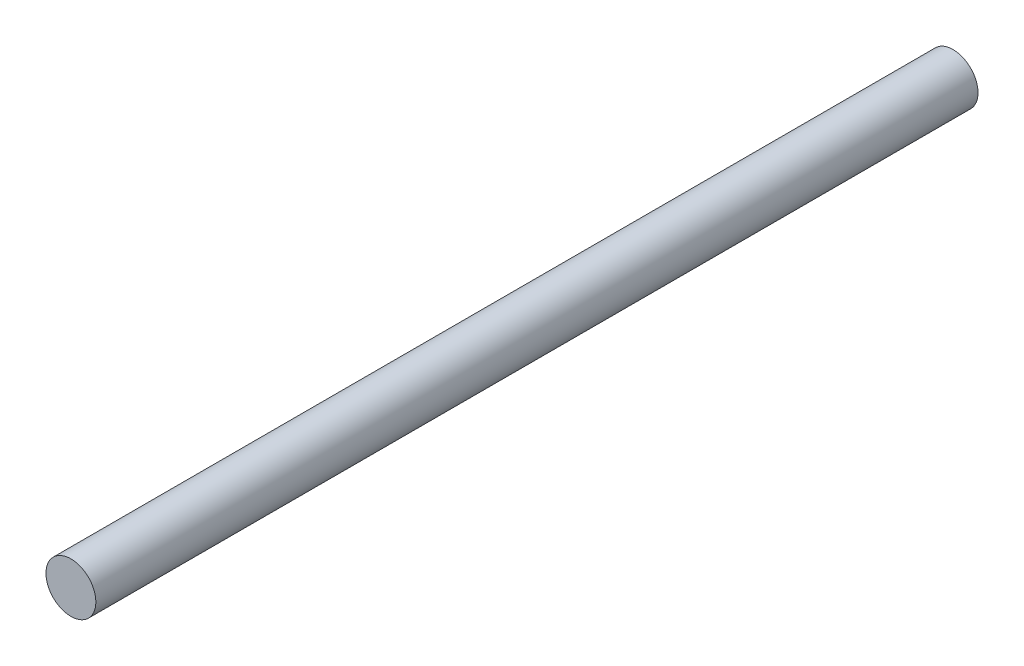
ISO-10303-21;
HEADER;
FILE_DESCRIPTION(('STEP AP214'),'2;1');
FILE_NAME('part.step','',(''),(''),'','','');
FILE_SCHEMA(('AUTOMOTIVE_DESIGN { 1 0 10303 214 1 1 1 1 }'));
ENDSEC;
DATA;
#1=APPLICATION_CONTEXT('core data for automotive mechanical design processes');
#2=APPLICATION_PROTOCOL_DEFINITION('international standard','automotive_design',2000,#1);
#3=PRODUCT_CONTEXT('',#1,'mechanical');
#4=PRODUCT('Part','Part','',(#3));
#5=PRODUCT_RELATED_PRODUCT_CATEGORY('part','',(#4));
#6=PRODUCT_DEFINITION_FORMATION('','',#4);
#7=PRODUCT_DEFINITION_CONTEXT('part definition',#1,'design');
#8=PRODUCT_DEFINITION('design','',#6,#7);
#9=PRODUCT_DEFINITION_SHAPE('','',#8);
#10=(LENGTH_UNIT() NAMED_UNIT(*) SI_UNIT(.MILLI.,.METRE.));
#11=(NAMED_UNIT(*) PLANE_ANGLE_UNIT() SI_UNIT($,.RADIAN.));
#12=(NAMED_UNIT(*) SI_UNIT($,.STERADIAN.) SOLID_ANGLE_UNIT());
#13=UNCERTAINTY_MEASURE_WITH_UNIT(LENGTH_MEASURE(1.E-05),#10,'distance_accuracy_value','');
#14=(GEOMETRIC_REPRESENTATION_CONTEXT(3) GLOBAL_UNCERTAINTY_ASSIGNED_CONTEXT((#13)) GLOBAL_UNIT_ASSIGNED_CONTEXT((#10,
#11,#12)) REPRESENTATION_CONTEXT('',''));
#15=CARTESIAN_POINT('',(0.,0.,0.));
#16=DIRECTION('',(0.,0.,1.));
#17=DIRECTION('',(1.,0.,0.));
#18=AXIS2_PLACEMENT_3D('',#15,#16,#17);
#19=CARTESIAN_POINT('',(0.,0.,221.));
#20=DIRECTION('',(0.,0.,-1.));
#21=DIRECTION('',(-1.,0.,0.));
#22=AXIS2_PLACEMENT_3D('',#19,#20,#21);
#23=CYLINDRICAL_SURFACE('',#22,12.5);
#24=CARTESIAN_POINT('',(0.,0.,221.));
#25=DIRECTION('',(0.,0.,1.));
#26=DIRECTION('',(1.,0.,0.));
#27=AXIS2_PLACEMENT_3D('',#24,#25,#26);
#28=CIRCLE('',#27,12.5);
#29=CARTESIAN_POINT('',(12.5,0.,221.));
#30=VERTEX_POINT('',#29);
#31=EDGE_CURVE('E10',#30,#30,#28,.T.);
#32=ORIENTED_EDGE('',*,*,#31,.F.);
#33=EDGE_LOOP('',(#32));
#34=FACE_BOUND('',#33,.T.);
#35=CARTESIAN_POINT('',(0.,0.,-221.));
#36=DIRECTION('',(0.,0.,1.));
#37=DIRECTION('',(1.,0.,0.));
#38=AXIS2_PLACEMENT_3D('',#35,#36,#37);
#39=CIRCLE('',#38,12.5);
#40=CARTESIAN_POINT('',(12.5,0.,-221.));
#41=VERTEX_POINT('',#40);
#42=EDGE_CURVE('E35',#41,#41,#39,.T.);
#43=ORIENTED_EDGE('',*,*,#42,.T.);
#44=EDGE_LOOP('',(#43));
#45=FACE_BOUND('',#44,.T.);
#46=ADVANCED_FACE('F32',(#34,#45),#23,.T.);
#47=CARTESIAN_POINT('',(0.,0.,221.));
#48=DIRECTION('',(0.,0.,1.));
#49=DIRECTION('',(1.,0.,0.));
#50=AXIS2_PLACEMENT_3D('',#47,#48,#49);
#51=PLANE('',#50);
#52=ORIENTED_EDGE('',*,*,#31,.T.);
#53=EDGE_LOOP('',(#52));
#54=FACE_BOUND('',#53,.T.);
#55=ADVANCED_FACE('F47',(#54),#51,.T.);
#56=CARTESIAN_POINT('',(0.,0.,-221.));
#57=DIRECTION('',(0.,0.,1.));
#58=DIRECTION('',(1.,0.,0.));
#59=AXIS2_PLACEMENT_3D('',#56,#57,#58);
#60=PLANE('',#59);
#61=ORIENTED_EDGE('',*,*,#42,.F.);
#62=EDGE_LOOP('',(#61));
#63=FACE_BOUND('',#62,.T.);
#64=ADVANCED_FACE('F45',(#63),#60,.F.);
#65=CLOSED_SHELL('',(#46,#55,#64));
#66=MANIFOLD_SOLID_BREP('B2',#65);
#67=ADVANCED_BREP_SHAPE_REPRESENTATION('',(#18,#66),#14);
#68=SHAPE_DEFINITION_REPRESENTATION(#9,#67);
ENDSEC;
END-ISO-10303-21;
